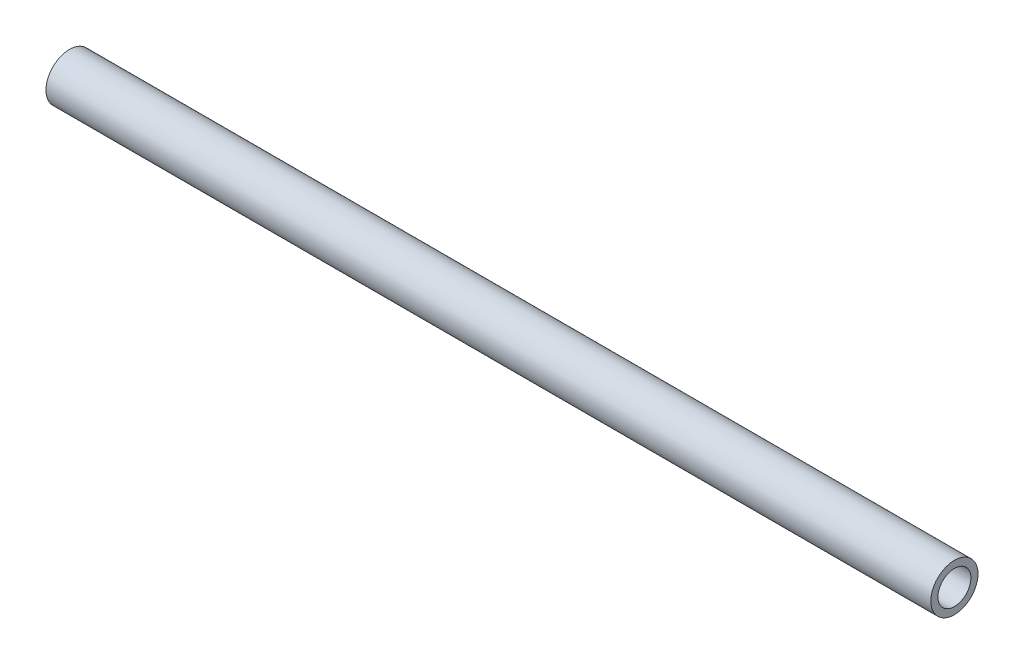
ISO-10303-21;
HEADER;
FILE_DESCRIPTION(('STEP AP214'),'2;1');
FILE_NAME('part.step','',(''),(''),'','','');
FILE_SCHEMA(('AUTOMOTIVE_DESIGN { 1 0 10303 214 1 1 1 1 }'));
ENDSEC;
DATA;
#1=APPLICATION_CONTEXT('core data for automotive mechanical design processes');
#2=APPLICATION_PROTOCOL_DEFINITION('international standard','automotive_design',2000,#1);
#3=PRODUCT_CONTEXT('',#1,'mechanical');
#4=PRODUCT('Part','Part','',(#3));
#5=PRODUCT_RELATED_PRODUCT_CATEGORY('part','',(#4));
#6=PRODUCT_DEFINITION_FORMATION('','',#4);
#7=PRODUCT_DEFINITION_CONTEXT('part definition',#1,'design');
#8=PRODUCT_DEFINITION('design','',#6,#7);
#9=PRODUCT_DEFINITION_SHAPE('','',#8);
#10=(LENGTH_UNIT() NAMED_UNIT(*) SI_UNIT(.MILLI.,.METRE.));
#11=(NAMED_UNIT(*) PLANE_ANGLE_UNIT() SI_UNIT($,.RADIAN.));
#12=(NAMED_UNIT(*) SI_UNIT($,.STERADIAN.) SOLID_ANGLE_UNIT());
#13=UNCERTAINTY_MEASURE_WITH_UNIT(LENGTH_MEASURE(1.E-05),#10,'distance_accuracy_value','');
#14=(GEOMETRIC_REPRESENTATION_CONTEXT(3) GLOBAL_UNCERTAINTY_ASSIGNED_CONTEXT((#13)) GLOBAL_UNIT_ASSIGNED_CONTEXT((#10,
#11,#12)) REPRESENTATION_CONTEXT('',''));
#15=CARTESIAN_POINT('',(0.,0.,0.));
#16=DIRECTION('',(0.,0.,1.));
#17=DIRECTION('',(1.,0.,0.));
#18=AXIS2_PLACEMENT_3D('',#15,#16,#17);
#19=CARTESIAN_POINT('',(0.,0.,0.));
#20=DIRECTION('',(1.,0.,0.));
#21=DIRECTION('',(0.,0.,-1.));
#22=AXIS2_PLACEMENT_3D('',#19,#20,#21);
#23=PLANE('',#22);
#24=CARTESIAN_POINT('',(0.,0.,0.));
#25=DIRECTION('',(1.,0.,0.));
#26=DIRECTION('',(0.,0.,-1.));
#27=AXIS2_PLACEMENT_3D('',#24,#25,#26);
#28=CIRCLE('',#27,7.);
#29=CARTESIAN_POINT('',(0.,0.,-7.));
#30=VERTEX_POINT('',#29);
#31=EDGE_CURVE('E58',#30,#30,#28,.T.);
#32=ORIENTED_EDGE('',*,*,#31,.T.);
#33=EDGE_LOOP('',(#32));
#34=FACE_BOUND('',#33,.T.);
#35=CARTESIAN_POINT('',(0.,0.,0.));
#36=DIRECTION('',(1.,0.,0.));
#37=DIRECTION('',(0.,0.,-1.));
#38=AXIS2_PLACEMENT_3D('',#35,#36,#37);
#39=CIRCLE('',#38,10.);
#40=CARTESIAN_POINT('',(0.,0.,-10.));
#41=VERTEX_POINT('',#40);
#42=EDGE_CURVE('E47',#41,#41,#39,.T.);
#43=ORIENTED_EDGE('',*,*,#42,.F.);
#44=EDGE_LOOP('',(#43));
#45=FACE_BOUND('',#44,.T.);
#46=ADVANCED_FACE('F43',(#34,#45),#23,.F.);
#47=CARTESIAN_POINT('',(375.5,0.,0.));
#48=DIRECTION('',(1.,0.,0.));
#49=DIRECTION('',(0.,0.,-1.));
#50=AXIS2_PLACEMENT_3D('',#47,#48,#49);
#51=PLANE('',#50);
#52=CARTESIAN_POINT('',(375.5,0.,0.));
#53=DIRECTION('',(1.,0.,0.));
#54=DIRECTION('',(0.,0.,-1.));
#55=AXIS2_PLACEMENT_3D('',#52,#53,#54);
#56=CIRCLE('',#55,7.);
#57=CARTESIAN_POINT('',(375.5,0.,-7.));
#58=VERTEX_POINT('',#57);
#59=EDGE_CURVE('E54',#58,#58,#56,.T.);
#60=ORIENTED_EDGE('',*,*,#59,.F.);
#61=EDGE_LOOP('',(#60));
#62=FACE_BOUND('',#61,.T.);
#63=CARTESIAN_POINT('',(375.5,0.,0.));
#64=DIRECTION('',(1.,0.,0.));
#65=DIRECTION('',(0.,0.,-1.));
#66=AXIS2_PLACEMENT_3D('',#63,#64,#65);
#67=CIRCLE('',#66,10.);
#68=CARTESIAN_POINT('',(375.5,0.,-10.));
#69=VERTEX_POINT('',#68);
#70=EDGE_CURVE('E11',#69,#69,#67,.T.);
#71=ORIENTED_EDGE('',*,*,#70,.T.);
#72=EDGE_LOOP('',(#71));
#73=FACE_BOUND('',#72,.T.);
#74=ADVANCED_FACE('F71',(#62,#73),#51,.T.);
#75=CARTESIAN_POINT('',(0.,0.,0.));
#76=DIRECTION('',(1.,0.,0.));
#77=DIRECTION('',(0.,0.,-1.));
#78=AXIS2_PLACEMENT_3D('',#75,#76,#77);
#79=CYLINDRICAL_SURFACE('',#78,10.);
#80=ORIENTED_EDGE('',*,*,#70,.F.);
#81=EDGE_LOOP('',(#80));
#82=FACE_BOUND('',#81,.T.);
#83=ORIENTED_EDGE('',*,*,#42,.T.);
#84=EDGE_LOOP('',(#83));
#85=FACE_BOUND('',#84,.T.);
#86=ADVANCED_FACE('F45',(#82,#85),#79,.T.);
#87=CARTESIAN_POINT('',(0.,0.,0.));
#88=DIRECTION('',(1.,0.,0.));
#89=DIRECTION('',(0.,0.,-1.));
#90=AXIS2_PLACEMENT_3D('',#87,#88,#89);
#91=CYLINDRICAL_SURFACE('',#90,7.);
#92=ORIENTED_EDGE('',*,*,#59,.T.);
#93=EDGE_LOOP('',(#92));
#94=FACE_BOUND('',#93,.T.);
#95=ORIENTED_EDGE('',*,*,#31,.F.);
#96=EDGE_LOOP('',(#95));
#97=FACE_BOUND('',#96,.T.);
#98=ADVANCED_FACE('F64',(#94,#97),#91,.F.);
#99=CLOSED_SHELL('',(#46,#74,#86,#98));
#100=MANIFOLD_SOLID_BREP('B2',#99);
#101=ADVANCED_BREP_SHAPE_REPRESENTATION('',(#18,#100),#14);
#102=SHAPE_DEFINITION_REPRESENTATION(#9,#101);
ENDSEC;
END-ISO-10303-21;
